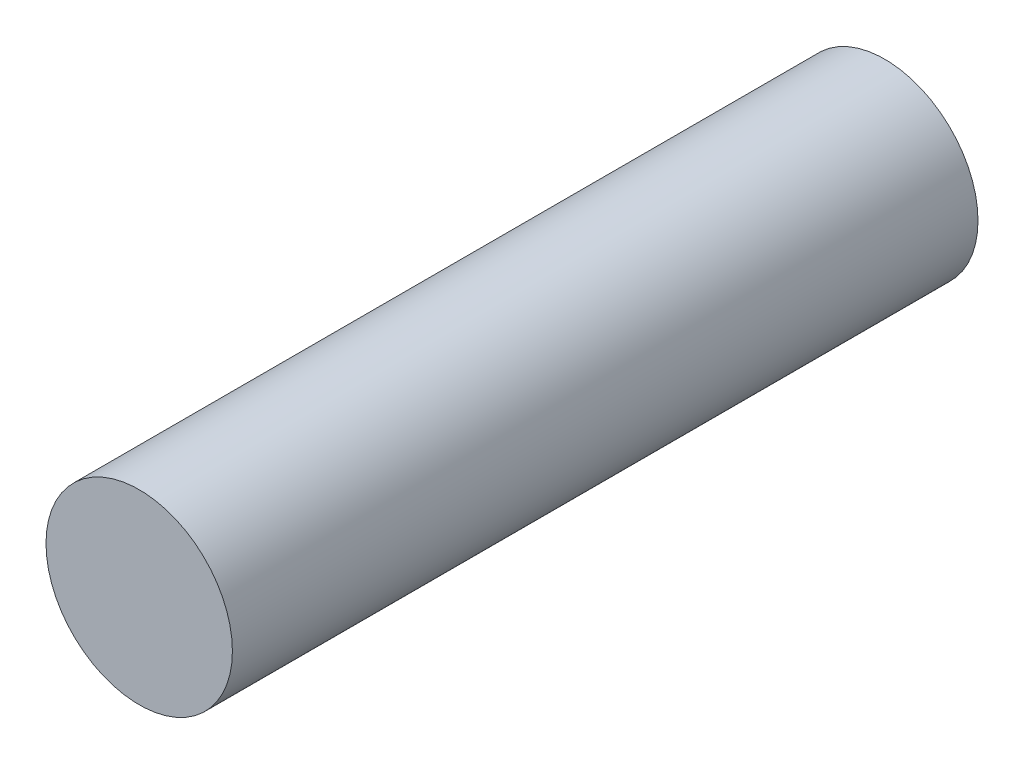
ISO-10303-21;
HEADER;
FILE_DESCRIPTION(('STEP AP214'),'2;1');
FILE_NAME('part.step','',(''),(''),'','','');
FILE_SCHEMA(('AUTOMOTIVE_DESIGN { 1 0 10303 214 1 1 1 1 }'));
ENDSEC;
DATA;
#1=APPLICATION_CONTEXT('core data for automotive mechanical design processes');
#2=APPLICATION_PROTOCOL_DEFINITION('international standard','automotive_design',2000,#1);
#3=PRODUCT_CONTEXT('',#1,'mechanical');
#4=PRODUCT('Part','Part','',(#3));
#5=PRODUCT_RELATED_PRODUCT_CATEGORY('part','',(#4));
#6=PRODUCT_DEFINITION_FORMATION('','',#4);
#7=PRODUCT_DEFINITION_CONTEXT('part definition',#1,'design');
#8=PRODUCT_DEFINITION('design','',#6,#7);
#9=PRODUCT_DEFINITION_SHAPE('','',#8);
#10=(LENGTH_UNIT() NAMED_UNIT(*) SI_UNIT(.MILLI.,.METRE.));
#11=(NAMED_UNIT(*) PLANE_ANGLE_UNIT() SI_UNIT($,.RADIAN.));
#12=(NAMED_UNIT(*) SI_UNIT($,.STERADIAN.) SOLID_ANGLE_UNIT());
#13=UNCERTAINTY_MEASURE_WITH_UNIT(LENGTH_MEASURE(1.E-05),#10,'distance_accuracy_value','');
#14=(GEOMETRIC_REPRESENTATION_CONTEXT(3) GLOBAL_UNCERTAINTY_ASSIGNED_CONTEXT((#13)) GLOBAL_UNIT_ASSIGNED_CONTEXT((#10,
#11,#12)) REPRESENTATION_CONTEXT('',''));
#15=CARTESIAN_POINT('',(0.,0.,0.));
#16=DIRECTION('',(0.,0.,1.));
#17=DIRECTION('',(1.,0.,0.));
#18=AXIS2_PLACEMENT_3D('',#15,#16,#17);
#19=CARTESIAN_POINT('',(0.,0.,12.7));
#20=DIRECTION('',(0.,0.,-1.));
#21=DIRECTION('',(-1.,0.,0.));
#22=AXIS2_PLACEMENT_3D('',#19,#20,#21);
#23=PLANE('',#22);
#24=CARTESIAN_POINT('',(0.,0.,12.7));
#25=DIRECTION('',(0.,0.,-1.));
#26=DIRECTION('',(-1.,0.,0.));
#27=AXIS2_PLACEMENT_3D('',#24,#25,#26);
#28=CIRCLE('',#27,1.5875);
#29=CARTESIAN_POINT('',(-1.5875,0.,12.7));
#30=VERTEX_POINT('',#29);
#31=EDGE_CURVE('E20',#30,#30,#28,.T.);
#32=ORIENTED_EDGE('',*,*,#31,.F.);
#33=EDGE_LOOP('',(#32));
#34=FACE_BOUND('',#33,.T.);
#35=ADVANCED_FACE('F17',(#34),#23,.F.);
#36=CARTESIAN_POINT('',(0.,0.,0.));
#37=DIRECTION('',(0.,0.,-1.));
#38=DIRECTION('',(-1.,0.,0.));
#39=AXIS2_PLACEMENT_3D('',#36,#37,#38);
#40=PLANE('',#39);
#41=CARTESIAN_POINT('',(0.,0.,0.));
#42=DIRECTION('',(0.,0.,-1.));
#43=DIRECTION('',(-1.,0.,0.));
#44=AXIS2_PLACEMENT_3D('',#41,#42,#43);
#45=CIRCLE('',#44,1.5875);
#46=CARTESIAN_POINT('',(-1.5875,0.,0.));
#47=VERTEX_POINT('',#46);
#48=EDGE_CURVE('E10',#47,#47,#45,.F.);
#49=ORIENTED_EDGE('',*,*,#48,.F.);
#50=EDGE_LOOP('',(#49));
#51=FACE_BOUND('',#50,.T.);
#52=ADVANCED_FACE('F32',(#51),#40,.T.);
#53=CARTESIAN_POINT('',(0.,0.,12.7));
#54=DIRECTION('',(0.,0.,-1.));
#55=DIRECTION('',(-1.,0.,0.));
#56=AXIS2_PLACEMENT_3D('',#53,#54,#55);
#57=CYLINDRICAL_SURFACE('',#56,1.5875);
#58=ORIENTED_EDGE('',*,*,#48,.T.);
#59=EDGE_LOOP('',(#58));
#60=FACE_BOUND('',#59,.T.);
#61=ORIENTED_EDGE('',*,*,#31,.T.);
#62=EDGE_LOOP('',(#61));
#63=FACE_BOUND('',#62,.T.);
#64=ADVANCED_FACE('F29',(#60,#63),#57,.T.);
#65=CLOSED_SHELL('',(#35,#52,#64));
#66=MANIFOLD_SOLID_BREP('B1',#65);
#67=ADVANCED_BREP_SHAPE_REPRESENTATION('',(#18,#66),#14);
#68=SHAPE_DEFINITION_REPRESENTATION(#9,#67);
ENDSEC;
END-ISO-10303-21;
